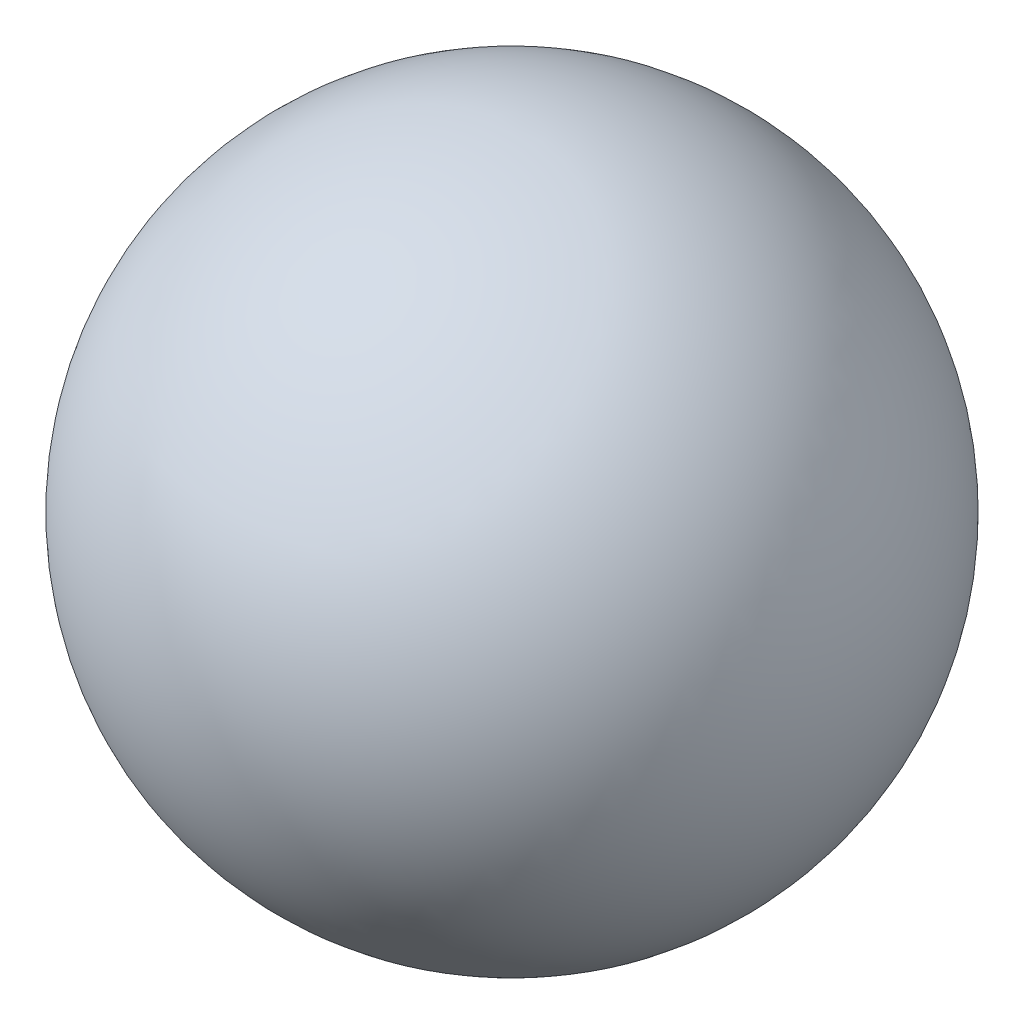
ISO-10303-21;
HEADER;
FILE_DESCRIPTION(('STEP AP214'),'2;1');
FILE_NAME('part.step','',(''),(''),'','','');
FILE_SCHEMA(('AUTOMOTIVE_DESIGN { 1 0 10303 214 1 1 1 1 }'));
ENDSEC;
DATA;
#1=APPLICATION_CONTEXT('core data for automotive mechanical design processes');
#2=APPLICATION_PROTOCOL_DEFINITION('international standard','automotive_design',2000,#1);
#3=PRODUCT_CONTEXT('',#1,'mechanical');
#4=PRODUCT('Part','Part','',(#3));
#5=PRODUCT_RELATED_PRODUCT_CATEGORY('part','',(#4));
#6=PRODUCT_DEFINITION_FORMATION('','',#4);
#7=PRODUCT_DEFINITION_CONTEXT('part definition',#1,'design');
#8=PRODUCT_DEFINITION('design','',#6,#7);
#9=PRODUCT_DEFINITION_SHAPE('','',#8);
#10=(LENGTH_UNIT() NAMED_UNIT(*) SI_UNIT(.MILLI.,.METRE.));
#11=(NAMED_UNIT(*) PLANE_ANGLE_UNIT() SI_UNIT($,.RADIAN.));
#12=(NAMED_UNIT(*) SI_UNIT($,.STERADIAN.) SOLID_ANGLE_UNIT());
#13=UNCERTAINTY_MEASURE_WITH_UNIT(LENGTH_MEASURE(1.E-05),#10,'distance_accuracy_value','');
#14=(GEOMETRIC_REPRESENTATION_CONTEXT(3) GLOBAL_UNCERTAINTY_ASSIGNED_CONTEXT((#13)) GLOBAL_UNIT_ASSIGNED_CONTEXT((#10,
#11,#12)) REPRESENTATION_CONTEXT('',''));
#15=CARTESIAN_POINT('',(0.,0.,0.));
#16=DIRECTION('',(0.,0.,1.));
#17=DIRECTION('',(1.,0.,0.));
#18=AXIS2_PLACEMENT_3D('',#15,#16,#17);
#19=CARTESIAN_POINT('',(0.,0.,0.));
#20=DIRECTION('',(0.,-1.,0.));
#21=DIRECTION('',(-1.,0.,0.));
#22=AXIS2_PLACEMENT_3D('',#19,#20,#21);
#23=SPHERICAL_SURFACE('',#22,22.25);
#24=CARTESIAN_POINT('',(0.,-22.25,0.));
#25=VERTEX_POINT('',#24);
#26=VERTEX_LOOP('',#25);
#27=FACE_BOUND('',#26,.T.);
#28=ADVANCED_FACE('F28',(#27),#23,.T.);
#29=CLOSED_SHELL('',(#28));
#30=MANIFOLD_SOLID_BREP('B2',#29);
#31=ADVANCED_BREP_SHAPE_REPRESENTATION('',(#18,#30),#14);
#32=SHAPE_DEFINITION_REPRESENTATION(#9,#31);
ENDSEC;
END-ISO-10303-21;
